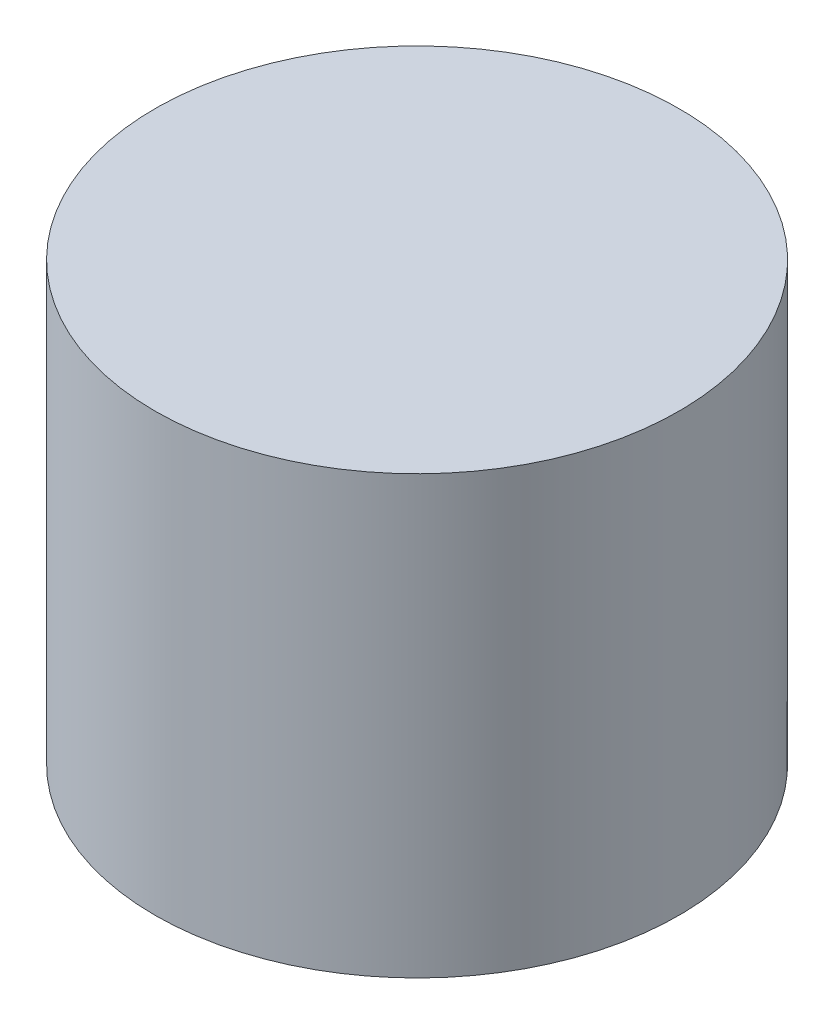
ISO-10303-21;
HEADER;
FILE_DESCRIPTION(('STEP AP214'),'2;1');
FILE_NAME('part.step','',(''),(''),'','','');
FILE_SCHEMA(('AUTOMOTIVE_DESIGN { 1 0 10303 214 1 1 1 1 }'));
ENDSEC;
DATA;
#1=APPLICATION_CONTEXT('core data for automotive mechanical design processes');
#2=APPLICATION_PROTOCOL_DEFINITION('international standard','automotive_design',2000,#1);
#3=PRODUCT_CONTEXT('',#1,'mechanical');
#4=PRODUCT('Part','Part','',(#3));
#5=PRODUCT_RELATED_PRODUCT_CATEGORY('part','',(#4));
#6=PRODUCT_DEFINITION_FORMATION('','',#4);
#7=PRODUCT_DEFINITION_CONTEXT('part definition',#1,'design');
#8=PRODUCT_DEFINITION('design','',#6,#7);
#9=PRODUCT_DEFINITION_SHAPE('','',#8);
#10=(LENGTH_UNIT() NAMED_UNIT(*) SI_UNIT(.MILLI.,.METRE.));
#11=(NAMED_UNIT(*) PLANE_ANGLE_UNIT() SI_UNIT($,.RADIAN.));
#12=(NAMED_UNIT(*) SI_UNIT($,.STERADIAN.) SOLID_ANGLE_UNIT());
#13=UNCERTAINTY_MEASURE_WITH_UNIT(LENGTH_MEASURE(1.E-05),#10,'distance_accuracy_value','');
#14=(GEOMETRIC_REPRESENTATION_CONTEXT(3) GLOBAL_UNCERTAINTY_ASSIGNED_CONTEXT((#13)) GLOBAL_UNIT_ASSIGNED_CONTEXT((#10,
#11,#12)) REPRESENTATION_CONTEXT('',''));
#15=CARTESIAN_POINT('',(0.,0.,0.));
#16=DIRECTION('',(0.,0.,1.));
#17=DIRECTION('',(1.,0.,0.));
#18=AXIS2_PLACEMENT_3D('',#15,#16,#17);
#19=CARTESIAN_POINT('',(0.,10.,0.));
#20=DIRECTION('',(0.,-1.,0.));
#21=DIRECTION('',(0.,0.,-1.));
#22=AXIS2_PLACEMENT_3D('',#19,#20,#21);
#23=CYLINDRICAL_SURFACE('',#22,6.);
#24=CARTESIAN_POINT('',(0.,10.,0.));
#25=DIRECTION('',(0.,1.,0.));
#26=DIRECTION('',(0.,0.,1.));
#27=AXIS2_PLACEMENT_3D('',#24,#25,#26);
#28=CIRCLE('',#27,6.);
#29=CARTESIAN_POINT('',(0.,10.,6.));
#30=VERTEX_POINT('',#29);
#31=EDGE_CURVE('E10',#30,#30,#28,.T.);
#32=ORIENTED_EDGE('',*,*,#31,.F.);
#33=EDGE_LOOP('',(#32));
#34=FACE_BOUND('',#33,.T.);
#35=CARTESIAN_POINT('',(0.,0.,0.));
#36=DIRECTION('',(0.,1.,0.));
#37=DIRECTION('',(0.,0.,1.));
#38=AXIS2_PLACEMENT_3D('',#35,#36,#37);
#39=CIRCLE('',#38,6.);
#40=CARTESIAN_POINT('',(0.,0.,6.));
#41=VERTEX_POINT('',#40);
#42=EDGE_CURVE('E32',#41,#41,#39,.T.);
#43=ORIENTED_EDGE('',*,*,#42,.T.);
#44=EDGE_LOOP('',(#43));
#45=FACE_BOUND('',#44,.T.);
#46=ADVANCED_FACE('F29',(#34,#45),#23,.T.);
#47=CARTESIAN_POINT('',(0.,10.,0.));
#48=DIRECTION('',(0.,1.,0.));
#49=DIRECTION('',(0.,0.,1.));
#50=AXIS2_PLACEMENT_3D('',#47,#48,#49);
#51=PLANE('',#50);
#52=ORIENTED_EDGE('',*,*,#31,.T.);
#53=EDGE_LOOP('',(#52));
#54=FACE_BOUND('',#53,.T.);
#55=ADVANCED_FACE('F44',(#54),#51,.T.);
#56=CARTESIAN_POINT('',(0.,0.,0.));
#57=DIRECTION('',(0.,1.,0.));
#58=DIRECTION('',(0.,0.,1.));
#59=AXIS2_PLACEMENT_3D('',#56,#57,#58);
#60=PLANE('',#59);
#61=ORIENTED_EDGE('',*,*,#42,.F.);
#62=EDGE_LOOP('',(#61));
#63=FACE_BOUND('',#62,.T.);
#64=ADVANCED_FACE('F42',(#63),#60,.F.);
#65=CLOSED_SHELL('',(#46,#55,#64));
#66=MANIFOLD_SOLID_BREP('B2',#65);
#67=ADVANCED_BREP_SHAPE_REPRESENTATION('',(#18,#66),#14);
#68=SHAPE_DEFINITION_REPRESENTATION(#9,#67);
ENDSEC;
END-ISO-10303-21;
